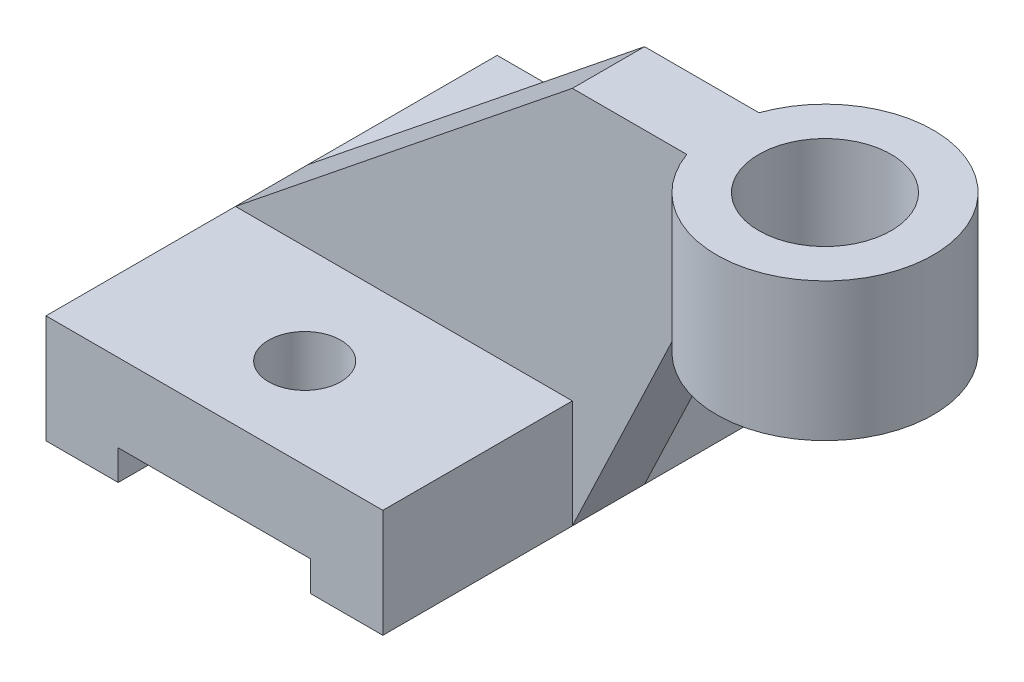
ISO-10303-21;
HEADER;
FILE_DESCRIPTION(('STEP AP214'),'2;1');
FILE_NAME('part.step','',(''),(''),'','','');
FILE_SCHEMA(('AUTOMOTIVE_DESIGN { 1 0 10303 214 1 1 1 1 }'));
ENDSEC;
DATA;
#1=APPLICATION_CONTEXT('core data for automotive mechanical design processes');
#2=APPLICATION_PROTOCOL_DEFINITION('international standard','automotive_design',2000,#1);
#3=PRODUCT_CONTEXT('',#1,'mechanical');
#4=PRODUCT('Part','Part','',(#3));
#5=PRODUCT_RELATED_PRODUCT_CATEGORY('part','',(#4));
#6=PRODUCT_DEFINITION_FORMATION('','',#4);
#7=PRODUCT_DEFINITION_CONTEXT('part definition',#1,'design');
#8=PRODUCT_DEFINITION('design','',#6,#7);
#9=PRODUCT_DEFINITION_SHAPE('','',#8);
#10=(LENGTH_UNIT() NAMED_UNIT(*) SI_UNIT(.MILLI.,.METRE.));
#11=(NAMED_UNIT(*) PLANE_ANGLE_UNIT() SI_UNIT($,.RADIAN.));
#12=(NAMED_UNIT(*) SI_UNIT($,.STERADIAN.) SOLID_ANGLE_UNIT());
#13=UNCERTAINTY_MEASURE_WITH_UNIT(LENGTH_MEASURE(1.E-05),#10,'distance_accuracy_value','');
#14=(GEOMETRIC_REPRESENTATION_CONTEXT(3) GLOBAL_UNCERTAINTY_ASSIGNED_CONTEXT((#13)) GLOBAL_UNIT_ASSIGNED_CONTEXT((#10,
#11,#12)) REPRESENTATION_CONTEXT('',''));
#15=CARTESIAN_POINT('',(0.,0.,0.));
#16=DIRECTION('',(0.,0.,1.));
#17=DIRECTION('',(1.,0.,0.));
#18=AXIS2_PLACEMENT_3D('',#15,#16,#17);
#19=CARTESIAN_POINT('',(56.,18.,0.));
#20=DIRECTION('',(1.,0.,0.));
#21=DIRECTION('',(0.,0.,-1.));
#22=AXIS2_PLACEMENT_3D('',#19,#20,#21);
#23=PLANE('',#22);
#24=DIRECTION('',(0.,0.,1.));
#25=VECTOR('',#24,1.);
#26=CARTESIAN_POINT('',(56.,18.,0.));
#27=LINE('',#26,#25);
#28=CARTESIAN_POINT('',(56.,18.,0.));
#29=VERTEX_POINT('',#28);
#30=CARTESIAN_POINT('',(56.,18.,31.5));
#31=VERTEX_POINT('',#30);
#32=EDGE_CURVE('E180',#29,#31,#27,.T.);
#33=ORIENTED_EDGE('',*,*,#32,.T.);
#34=DIRECTION('',(0.,-1.,0.));
#35=VECTOR('',#34,1.);
#36=CARTESIAN_POINT('',(56.,18.,31.5));
#37=LINE('',#36,#35);
#38=CARTESIAN_POINT('',(56.,0.,31.5));
#39=VERTEX_POINT('',#38);
#40=EDGE_CURVE('E168',#31,#39,#37,.T.);
#41=ORIENTED_EDGE('',*,*,#40,.T.);
#42=DIRECTION('',(0.,0.,1.));
#43=VECTOR('',#42,1.);
#44=CARTESIAN_POINT('',(56.,0.,0.));
#45=LINE('',#44,#43);
#46=CARTESIAN_POINT('',(56.,0.,0.));
#47=VERTEX_POINT('',#46);
#48=EDGE_CURVE('E178',#47,#39,#45,.T.);
#49=ORIENTED_EDGE('',*,*,#48,.F.);
#50=DIRECTION('',(0.,-1.,0.));
#51=VECTOR('',#50,1.);
#52=CARTESIAN_POINT('',(56.,18.,0.));
#53=LINE('',#52,#51);
#54=EDGE_CURVE('E215',#29,#47,#53,.T.);
#55=ORIENTED_EDGE('',*,*,#54,.F.);
#56=EDGE_LOOP('',(#33,#41,#49,#55));
#57=FACE_BOUND('',#56,.T.);
#58=ADVANCED_FACE('F43',(#57),#23,.T.);
#59=DIRECTION('',(0.,-1.,0.));
#60=VECTOR('',#59,1.);
#61=CARTESIAN_POINT('',(56.,18.,43.5));
#62=LINE('',#61,#60);
#63=CARTESIAN_POINT('',(56.,18.,43.5));
#64=VERTEX_POINT('',#63);
#65=CARTESIAN_POINT('',(56.,0.,43.5));
#66=VERTEX_POINT('',#65);
#67=EDGE_CURVE('E182',#64,#66,#62,.T.);
#68=ORIENTED_EDGE('',*,*,#67,.F.);
#69=CARTESIAN_POINT('',(56.,18.,75.));
#70=VERTEX_POINT('',#69);
#71=EDGE_CURVE('E232',#64,#70,#27,.T.);
#72=ORIENTED_EDGE('',*,*,#71,.T.);
#73=DIRECTION('',(0.,-1.,0.));
#74=VECTOR('',#73,1.);
#75=CARTESIAN_POINT('',(56.,18.,75.));
#76=LINE('',#75,#74);
#77=CARTESIAN_POINT('',(56.,0.,75.));
#78=VERTEX_POINT('',#77);
#79=EDGE_CURVE('E212',#70,#78,#76,.T.);
#80=ORIENTED_EDGE('',*,*,#79,.T.);
#81=EDGE_CURVE('E192',#66,#78,#45,.T.);
#82=ORIENTED_EDGE('',*,*,#81,.F.);
#83=EDGE_LOOP('',(#68,#72,#80,#82));
#84=FACE_BOUND('',#83,.T.);
#85=ADVANCED_FACE('F353',(#84),#23,.T.);
#86=CARTESIAN_POINT('',(0.,18.,0.));
#87=DIRECTION('',(0.,-1.,0.));
#88=DIRECTION('',(0.,0.,-1.));
#89=AXIS2_PLACEMENT_3D('',#86,#87,#88);
#90=PLANE('',#89);
#91=CARTESIAN_POINT('',(28.,18.,60.));
#92=DIRECTION('',(0.,1.,0.));
#93=DIRECTION('',(0.,0.,1.));
#94=AXIS2_PLACEMENT_3D('',#91,#92,#93);
#95=CIRCLE('',#94,5.99999999999999);
#96=CARTESIAN_POINT('',(28.,18.,66.));
#97=VERTEX_POINT('',#96);
#98=EDGE_CURVE('E235',#97,#97,#95,.F.);
#99=ORIENTED_EDGE('',*,*,#98,.T.);
#100=EDGE_LOOP('',(#99));
#101=FACE_BOUND('',#100,.T.);
#102=DIRECTION('',(1.,0.,0.));
#103=VECTOR('',#102,1.);
#104=CARTESIAN_POINT('',(0.,18.,43.5));
#105=LINE('',#104,#103);
#106=CARTESIAN_POINT('',(0.,18.,43.5));
#107=VERTEX_POINT('',#106);
#108=EDGE_CURVE('E61',#107,#64,#105,.T.);
#109=ORIENTED_EDGE('',*,*,#108,.F.);
#110=DIRECTION('',(0.,0.,1.));
#111=VECTOR('',#110,1.);
#112=CARTESIAN_POINT('',(0.,18.,0.));
#113=LINE('',#112,#111);
#114=CARTESIAN_POINT('',(0.,18.,75.));
#115=VERTEX_POINT('',#114);
#116=EDGE_CURVE('E221',#107,#115,#113,.T.);
#117=ORIENTED_EDGE('',*,*,#116,.T.);
#118=DIRECTION('',(1.,0.,0.));
#119=VECTOR('',#118,1.);
#120=CARTESIAN_POINT('',(0.,18.,75.));
#121=LINE('',#120,#119);
#122=EDGE_CURVE('E225',#115,#70,#121,.T.);
#123=ORIENTED_EDGE('',*,*,#122,.T.);
#124=ORIENTED_EDGE('',*,*,#71,.F.);
#125=EDGE_LOOP('',(#109,#117,#123,#124));
#126=FACE_BOUND('',#125,.T.);
#127=ADVANCED_FACE('F357',(#101,#126),#90,.F.);
#128=CARTESIAN_POINT('',(0.,0.,0.));
#129=DIRECTION('',(0.,-1.,0.));
#130=DIRECTION('',(0.,0.,-1.));
#131=AXIS2_PLACEMENT_3D('',#128,#129,#130);
#132=PLANE('',#131);
#133=DIRECTION('',(1.,0.,0.));
#134=VECTOR('',#133,1.);
#135=CARTESIAN_POINT('',(0.,0.,75.));
#136=LINE('',#135,#134);
#137=CARTESIAN_POINT('',(44.,0.,75.));
#138=VERTEX_POINT('',#137);
#139=EDGE_CURVE('E191',#138,#78,#136,.T.);
#140=ORIENTED_EDGE('',*,*,#139,.F.);
#141=DIRECTION('',(0.,0.,1.));
#142=VECTOR('',#141,1.);
#143=CARTESIAN_POINT('',(44.,0.,0.));
#144=LINE('',#143,#142);
#145=CARTESIAN_POINT('',(44.,0.,0.));
#146=VERTEX_POINT('',#145);
#147=EDGE_CURVE('E257',#146,#138,#144,.T.);
#148=ORIENTED_EDGE('',*,*,#147,.F.);
#149=DIRECTION('',(1.,0.,0.));
#150=VECTOR('',#149,1.);
#151=CARTESIAN_POINT('',(0.,0.,0.));
#152=LINE('',#151,#150);
#153=EDGE_CURVE('E188',#146,#47,#152,.T.);
#154=ORIENTED_EDGE('',*,*,#153,.T.);
#155=ORIENTED_EDGE('',*,*,#48,.T.);
#156=DIRECTION('',(0.,0.,1.));
#157=VECTOR('',#156,1.);
#158=CARTESIAN_POINT('',(56.,0.,0.));
#159=LINE('',#158,#157);
#160=EDGE_CURVE('E148',#39,#66,#159,.T.);
#161=ORIENTED_EDGE('',*,*,#160,.T.);
#162=ORIENTED_EDGE('',*,*,#81,.T.);
#163=EDGE_LOOP('',(#140,#148,#154,#155,#161,#162));
#164=FACE_BOUND('',#163,.T.);
#165=ADVANCED_FACE('F185',(#164),#132,.T.);
#166=CARTESIAN_POINT('',(0.,0.,75.));
#167=VERTEX_POINT('',#166);
#168=CARTESIAN_POINT('',(12.,0.,75.));
#169=VERTEX_POINT('',#168);
#170=EDGE_CURVE('E197',#167,#169,#136,.T.);
#171=ORIENTED_EDGE('',*,*,#170,.F.);
#172=DIRECTION('',(0.,0.,1.));
#173=VECTOR('',#172,1.);
#174=CARTESIAN_POINT('',(0.,0.,0.));
#175=LINE('',#174,#173);
#176=CARTESIAN_POINT('',(0.,0.,0.));
#177=VERTEX_POINT('',#176);
#178=EDGE_CURVE('E205',#177,#167,#175,.T.);
#179=ORIENTED_EDGE('',*,*,#178,.F.);
#180=CARTESIAN_POINT('',(12.,0.,0.));
#181=VERTEX_POINT('',#180);
#182=EDGE_CURVE('E199',#177,#181,#152,.T.);
#183=ORIENTED_EDGE('',*,*,#182,.T.);
#184=DIRECTION('',(0.,0.,1.));
#185=VECTOR('',#184,1.);
#186=CARTESIAN_POINT('',(12.,0.,0.));
#187=LINE('',#186,#185);
#188=EDGE_CURVE('E254',#181,#169,#187,.T.);
#189=ORIENTED_EDGE('',*,*,#188,.T.);
#190=EDGE_LOOP('',(#171,#179,#183,#189));
#191=FACE_BOUND('',#190,.T.);
#192=ADVANCED_FACE('F372',(#191),#132,.T.);
#193=CARTESIAN_POINT('',(0.,18.,0.));
#194=DIRECTION('',(0.,0.,-1.));
#195=DIRECTION('',(-1.,0.,0.));
#196=AXIS2_PLACEMENT_3D('',#193,#194,#195);
#197=PLANE('',#196);
#198=ORIENTED_EDGE('',*,*,#153,.F.);
#199=DIRECTION('',(0.,-1.,0.));
#200=VECTOR('',#199,1.);
#201=CARTESIAN_POINT('',(44.,0.,0.));
#202=LINE('',#201,#200);
#203=CARTESIAN_POINT('',(44.,5.,0.));
#204=VERTEX_POINT('',#203);
#205=EDGE_CURVE('E264',#204,#146,#202,.T.);
#206=ORIENTED_EDGE('',*,*,#205,.F.);
#207=DIRECTION('',(1.,0.,0.));
#208=VECTOR('',#207,1.);
#209=CARTESIAN_POINT('',(0.,5.,0.));
#210=LINE('',#209,#208);
#211=CARTESIAN_POINT('',(12.,5.,0.));
#212=VERTEX_POINT('',#211);
#213=EDGE_CURVE('E275',#212,#204,#210,.T.);
#214=ORIENTED_EDGE('',*,*,#213,.F.);
#215=DIRECTION('',(0.,1.,0.));
#216=VECTOR('',#215,1.);
#217=CARTESIAN_POINT('',(12.,0.,0.));
#218=LINE('',#217,#216);
#219=EDGE_CURVE('E251',#181,#212,#218,.T.);
#220=ORIENTED_EDGE('',*,*,#219,.F.);
#221=ORIENTED_EDGE('',*,*,#182,.F.);
#222=DIRECTION('',(0.,-1.,0.));
#223=VECTOR('',#222,1.);
#224=CARTESIAN_POINT('',(0.,18.,0.));
#225=LINE('',#224,#223);
#226=CARTESIAN_POINT('',(0.,18.,0.));
#227=VERTEX_POINT('',#226);
#228=EDGE_CURVE('E11',#227,#177,#225,.T.);
#229=ORIENTED_EDGE('',*,*,#228,.F.);
#230=DIRECTION('',(1.,0.,0.));
#231=VECTOR('',#230,1.);
#232=CARTESIAN_POINT('',(0.,18.,0.));
#233=LINE('',#232,#231);
#234=EDGE_CURVE('E207',#227,#29,#233,.T.);
#235=ORIENTED_EDGE('',*,*,#234,.T.);
#236=ORIENTED_EDGE('',*,*,#54,.T.);
#237=EDGE_LOOP('',(#198,#206,#214,#220,#221,#229,#235,#236));
#238=FACE_BOUND('',#237,.T.);
#239=ADVANCED_FACE('F45',(#238),#197,.T.);
#240=CARTESIAN_POINT('',(0.,18.,75.));
#241=DIRECTION('',(0.,0.,-1.));
#242=DIRECTION('',(-1.,0.,0.));
#243=AXIS2_PLACEMENT_3D('',#240,#241,#242);
#244=PLANE('',#243);
#245=DIRECTION('',(0.,-1.,0.));
#246=VECTOR('',#245,1.);
#247=CARTESIAN_POINT('',(44.,0.,75.));
#248=LINE('',#247,#246);
#249=CARTESIAN_POINT('',(44.,5.,75.));
#250=VERTEX_POINT('',#249);
#251=EDGE_CURVE('E269',#250,#138,#248,.T.);
#252=ORIENTED_EDGE('',*,*,#251,.T.);
#253=ORIENTED_EDGE('',*,*,#139,.T.);
#254=ORIENTED_EDGE('',*,*,#79,.F.);
#255=ORIENTED_EDGE('',*,*,#122,.F.);
#256=DIRECTION('',(0.,-1.,0.));
#257=VECTOR('',#256,1.);
#258=CARTESIAN_POINT('',(0.,18.,75.));
#259=LINE('',#258,#257);
#260=EDGE_CURVE('E53',#115,#167,#259,.T.);
#261=ORIENTED_EDGE('',*,*,#260,.T.);
#262=ORIENTED_EDGE('',*,*,#170,.T.);
#263=DIRECTION('',(0.,1.,0.));
#264=VECTOR('',#263,1.);
#265=CARTESIAN_POINT('',(12.,0.,75.));
#266=LINE('',#265,#264);
#267=CARTESIAN_POINT('',(12.,5.,75.));
#268=VERTEX_POINT('',#267);
#269=EDGE_CURVE('E260',#169,#268,#266,.T.);
#270=ORIENTED_EDGE('',*,*,#269,.T.);
#271=DIRECTION('',(1.,0.,0.));
#272=VECTOR('',#271,1.);
#273=CARTESIAN_POINT('',(0.,5.,75.));
#274=LINE('',#273,#272);
#275=EDGE_CURVE('E265',#268,#250,#274,.T.);
#276=ORIENTED_EDGE('',*,*,#275,.T.);
#277=EDGE_LOOP('',(#252,#253,#254,#255,#261,#262,#270,#276));
#278=FACE_BOUND('',#277,.T.);
#279=ADVANCED_FACE('F360',(#278),#244,.F.);
#280=CARTESIAN_POINT('',(28.,0.,60.));
#281=DIRECTION('',(0.,1.,0.));
#282=DIRECTION('',(0.,0.,1.));
#283=AXIS2_PLACEMENT_3D('',#280,#281,#282);
#284=CYLINDRICAL_SURFACE('',#283,5.99999999999999);
#285=ORIENTED_EDGE('',*,*,#98,.F.);
#286=EDGE_LOOP('',(#285));
#287=FACE_BOUND('',#286,.T.);
#288=CARTESIAN_POINT('',(28.,5.,60.));
#289=DIRECTION('',(0.,-1.,0.));
#290=DIRECTION('',(0.,0.,-1.));
#291=AXIS2_PLACEMENT_3D('',#288,#289,#290);
#292=CIRCLE('',#291,5.99999999999999);
#293=CARTESIAN_POINT('',(28.,5.,54.));
#294=VERTEX_POINT('',#293);
#295=EDGE_CURVE('E240',#294,#294,#292,.T.);
#296=ORIENTED_EDGE('',*,*,#295,.T.);
#297=EDGE_LOOP('',(#296));
#298=FACE_BOUND('',#297,.T.);
#299=ADVANCED_FACE('F363',(#287,#298),#284,.F.);
#300=CARTESIAN_POINT('',(28.,0.,15.));
#301=DIRECTION('',(0.,1.,0.));
#302=DIRECTION('',(0.,0.,1.));
#303=AXIS2_PLACEMENT_3D('',#300,#301,#302);
#304=CYLINDRICAL_SURFACE('',#303,5.99999999999999);
#305=CARTESIAN_POINT('',(28.,18.,15.));
#306=DIRECTION('',(0.,1.,0.));
#307=DIRECTION('',(0.,0.,1.));
#308=AXIS2_PLACEMENT_3D('',#305,#306,#307);
#309=CIRCLE('',#308,5.99999999999999);
#310=CARTESIAN_POINT('',(28.,18.,21.));
#311=VERTEX_POINT('',#310);
#312=EDGE_CURVE('E239',#311,#311,#309,.T.);
#313=ORIENTED_EDGE('',*,*,#312,.T.);
#314=EDGE_LOOP('',(#313));
#315=FACE_BOUND('',#314,.T.);
#316=CARTESIAN_POINT('',(28.,5.,15.));
#317=DIRECTION('',(0.,-1.,0.));
#318=DIRECTION('',(0.,0.,-1.));
#319=AXIS2_PLACEMENT_3D('',#316,#317,#318);
#320=CIRCLE('',#319,5.99999999999999);
#321=CARTESIAN_POINT('',(28.,5.,9.00000000000001));
#322=VERTEX_POINT('',#321);
#323=EDGE_CURVE('E47',#322,#322,#320,.F.);
#324=ORIENTED_EDGE('',*,*,#323,.F.);
#325=EDGE_LOOP('',(#324));
#326=FACE_BOUND('',#325,.T.);
#327=ADVANCED_FACE('F375',(#315,#326),#304,.F.);
#328=CARTESIAN_POINT('',(0.,18.,31.5));
#329=VERTEX_POINT('',#328);
#330=EDGE_CURVE('E217',#227,#329,#113,.T.);
#331=ORIENTED_EDGE('',*,*,#330,.T.);
#332=DIRECTION('',(1.,0.,0.));
#333=VECTOR('',#332,1.);
#334=CARTESIAN_POINT('',(0.,18.,31.5));
#335=LINE('',#334,#333);
#336=EDGE_CURVE('E286',#329,#31,#335,.T.);
#337=ORIENTED_EDGE('',*,*,#336,.T.);
#338=ORIENTED_EDGE('',*,*,#32,.F.);
#339=ORIENTED_EDGE('',*,*,#234,.F.);
#340=EDGE_LOOP('',(#331,#337,#338,#339));
#341=FACE_BOUND('',#340,.T.);
#342=ORIENTED_EDGE('',*,*,#312,.F.);
#343=EDGE_LOOP('',(#342));
#344=FACE_BOUND('',#343,.T.);
#345=ADVANCED_FACE('F369',(#341,#344),#90,.F.);
#346=CARTESIAN_POINT('',(0.,18.,0.));
#347=DIRECTION('',(1.,0.,0.));
#348=DIRECTION('',(0.,0.,-1.));
#349=AXIS2_PLACEMENT_3D('',#346,#347,#348);
#350=PLANE('',#349);
#351=ORIENTED_EDGE('',*,*,#116,.F.);
#352=DIRECTION('',(0.,0.,-1.));
#353=VECTOR('',#352,1.);
#354=CARTESIAN_POINT('',(0.,18.,43.5));
#355=LINE('',#354,#353);
#356=EDGE_CURVE('E68',#107,#329,#355,.T.);
#357=ORIENTED_EDGE('',*,*,#356,.T.);
#358=ORIENTED_EDGE('',*,*,#330,.F.);
#359=ORIENTED_EDGE('',*,*,#228,.T.);
#360=ORIENTED_EDGE('',*,*,#178,.T.);
#361=ORIENTED_EDGE('',*,*,#260,.F.);
#362=EDGE_LOOP('',(#351,#357,#358,#359,#360,#361));
#363=FACE_BOUND('',#362,.T.);
#364=ADVANCED_FACE('F365',(#363),#350,.F.);
#365=CARTESIAN_POINT('',(0.,5.,0.));
#366=DIRECTION('',(0.,-1.,0.));
#367=DIRECTION('',(0.,0.,-1.));
#368=AXIS2_PLACEMENT_3D('',#365,#366,#367);
#369=PLANE('',#368);
#370=ORIENTED_EDGE('',*,*,#275,.F.);
#371=DIRECTION('',(0.,0.,1.));
#372=VECTOR('',#371,1.);
#373=CARTESIAN_POINT('',(12.,5.,0.));
#374=LINE('',#373,#372);
#375=EDGE_CURVE('E250',#212,#268,#374,.T.);
#376=ORIENTED_EDGE('',*,*,#375,.F.);
#377=ORIENTED_EDGE('',*,*,#213,.T.);
#378=DIRECTION('',(0.,0.,1.));
#379=VECTOR('',#378,1.);
#380=CARTESIAN_POINT('',(44.,5.,0.));
#381=LINE('',#380,#379);
#382=EDGE_CURVE('E247',#204,#250,#381,.T.);
#383=ORIENTED_EDGE('',*,*,#382,.T.);
#384=EDGE_LOOP('',(#370,#376,#377,#383));
#385=FACE_BOUND('',#384,.T.);
#386=ORIENTED_EDGE('',*,*,#295,.F.);
#387=EDGE_LOOP('',(#386));
#388=FACE_BOUND('',#387,.T.);
#389=ORIENTED_EDGE('',*,*,#323,.T.);
#390=EDGE_LOOP('',(#389));
#391=FACE_BOUND('',#390,.T.);
#392=ADVANCED_FACE('F368',(#385,#388,#391),#369,.T.);
#393=CARTESIAN_POINT('',(44.,0.,0.));
#394=DIRECTION('',(-1.,0.,0.));
#395=DIRECTION('',(0.,0.,1.));
#396=AXIS2_PLACEMENT_3D('',#393,#394,#395);
#397=PLANE('',#396);
#398=ORIENTED_EDGE('',*,*,#251,.F.);
#399=ORIENTED_EDGE('',*,*,#382,.F.);
#400=ORIENTED_EDGE('',*,*,#205,.T.);
#401=ORIENTED_EDGE('',*,*,#147,.T.);
#402=EDGE_LOOP('',(#398,#399,#400,#401));
#403=FACE_BOUND('',#402,.T.);
#404=ADVANCED_FACE('F382',(#403),#397,.T.);
#405=CARTESIAN_POINT('',(12.,0.,0.));
#406=DIRECTION('',(1.,0.,0.));
#407=DIRECTION('',(0.,0.,-1.));
#408=AXIS2_PLACEMENT_3D('',#405,#406,#407);
#409=PLANE('',#408);
#410=ORIENTED_EDGE('',*,*,#269,.F.);
#411=ORIENTED_EDGE('',*,*,#188,.F.);
#412=ORIENTED_EDGE('',*,*,#219,.T.);
#413=ORIENTED_EDGE('',*,*,#375,.T.);
#414=EDGE_LOOP('',(#410,#411,#412,#413));
#415=FACE_BOUND('',#414,.T.);
#416=ADVANCED_FACE('F385',(#415),#409,.T.);
#417=CARTESIAN_POINT('',(0.,18.,43.5));
#418=DIRECTION('',(0.626391108316048,-0.779508934793305,0.));
#419=DIRECTION('',(0.779508934793305,0.626391108316048,0.));
#420=AXIS2_PLACEMENT_3D('',#417,#418,#419);
#421=PLANE('',#420);
#422=DIRECTION('',(-0.779508934793305,-0.626391108316048,0.));
#423=VECTOR('',#422,1.);
#424=CARTESIAN_POINT('',(0.,18.,31.5));
#425=LINE('',#424,#423);
#426=CARTESIAN_POINT('',(56.,63.,31.5));
#427=VERTEX_POINT('',#426);
#428=EDGE_CURVE('E290',#427,#329,#425,.T.);
#429=ORIENTED_EDGE('',*,*,#428,.T.);
#430=ORIENTED_EDGE('',*,*,#356,.F.);
#431=DIRECTION('',(-0.779508934793305,-0.626391108316048,0.));
#432=VECTOR('',#431,1.);
#433=CARTESIAN_POINT('',(0.,18.,43.5));
#434=LINE('',#433,#432);
#435=CARTESIAN_POINT('',(56.,63.,43.5));
#436=VERTEX_POINT('',#435);
#437=EDGE_CURVE('E289',#436,#107,#434,.T.);
#438=ORIENTED_EDGE('',*,*,#437,.F.);
#439=DIRECTION('',(0.,0.,-1.));
#440=VECTOR('',#439,1.);
#441=CARTESIAN_POINT('',(56.,63.,43.5));
#442=LINE('',#441,#440);
#443=EDGE_CURVE('E282',#436,#427,#442,.T.);
#444=ORIENTED_EDGE('',*,*,#443,.T.);
#445=EDGE_LOOP('',(#429,#430,#438,#444));
#446=FACE_BOUND('',#445,.T.);
#447=ADVANCED_FACE('F392',(#446),#421,.F.);
#448=CARTESIAN_POINT('',(0.,0.,43.5));
#449=DIRECTION('',(0.,0.,1.));
#450=DIRECTION('',(1.,0.,0.));
#451=AXIS2_PLACEMENT_3D('',#448,#449,#450);
#452=PLANE('',#451);
#453=ORIENTED_EDGE('',*,*,#437,.T.);
#454=ORIENTED_EDGE('',*,*,#108,.T.);
#455=ORIENTED_EDGE('',*,*,#67,.T.);
#456=DIRECTION('',(0.429598959000717,0.903019786286824,0.));
#457=VECTOR('',#456,1.);
#458=CARTESIAN_POINT('',(56.,0.,43.5));
#459=LINE('',#458,#457);
#460=CARTESIAN_POINT('',(75.0294372515229,40.,43.5));
#461=VERTEX_POINT('',#460);
#462=EDGE_CURVE('E154',#66,#461,#459,.T.);
#463=ORIENTED_EDGE('',*,*,#462,.T.);
#464=DIRECTION('',(0.,1.,0.));
#465=VECTOR('',#464,1.);
#466=CARTESIAN_POINT('',(75.0294372515229,40.,43.5));
#467=LINE('',#466,#465);
#468=CARTESIAN_POINT('',(75.0294372515229,63.,43.5));
#469=VERTEX_POINT('',#468);
#470=EDGE_CURVE('E299',#461,#469,#467,.T.);
#471=ORIENTED_EDGE('',*,*,#470,.T.);
#472=DIRECTION('',(1.,0.,0.));
#473=VECTOR('',#472,1.);
#474=CARTESIAN_POINT('',(56.,63.,43.5));
#475=LINE('',#474,#473);
#476=EDGE_CURVE('E312',#436,#469,#475,.T.);
#477=ORIENTED_EDGE('',*,*,#476,.F.);
#478=EDGE_LOOP('',(#453,#454,#455,#463,#471,#477));
#479=FACE_BOUND('',#478,.T.);
#480=ADVANCED_FACE('F332',(#479),#452,.T.);
#481=CARTESIAN_POINT('',(0.,0.,31.5));
#482=DIRECTION('',(0.,0.,1.));
#483=DIRECTION('',(1.,0.,0.));
#484=AXIS2_PLACEMENT_3D('',#481,#482,#483);
#485=PLANE('',#484);
#486=ORIENTED_EDGE('',*,*,#428,.F.);
#487=DIRECTION('',(-1.,0.,0.));
#488=VECTOR('',#487,1.);
#489=CARTESIAN_POINT('',(56.,63.,31.5));
#490=LINE('',#489,#488);
#491=CARTESIAN_POINT('',(75.0294372515229,63.,31.5));
#492=VERTEX_POINT('',#491);
#493=EDGE_CURVE('E305',#492,#427,#490,.T.);
#494=ORIENTED_EDGE('',*,*,#493,.F.);
#495=DIRECTION('',(0.,1.,0.));
#496=VECTOR('',#495,1.);
#497=CARTESIAN_POINT('',(75.0294372515229,40.,31.5));
#498=LINE('',#497,#496);
#499=CARTESIAN_POINT('',(75.0294372515229,40.,31.5));
#500=VERTEX_POINT('',#499);
#501=EDGE_CURVE('E171',#500,#492,#498,.T.);
#502=ORIENTED_EDGE('',*,*,#501,.F.);
#503=DIRECTION('',(0.429598959000717,0.903019786286824,0.));
#504=VECTOR('',#503,1.);
#505=CARTESIAN_POINT('',(56.,0.,31.5));
#506=LINE('',#505,#504);
#507=EDGE_CURVE('E151',#39,#500,#506,.T.);
#508=ORIENTED_EDGE('',*,*,#507,.F.);
#509=ORIENTED_EDGE('',*,*,#40,.F.);
#510=ORIENTED_EDGE('',*,*,#336,.F.);
#511=EDGE_LOOP('',(#486,#494,#502,#508,#509,#510));
#512=FACE_BOUND('',#511,.T.);
#513=ADVANCED_FACE('F166',(#512),#485,.F.);
#514=CARTESIAN_POINT('',(92.,40.,37.5));
#515=DIRECTION('',(0.,1.,0.));
#516=DIRECTION('',(0.,0.,1.));
#517=AXIS2_PLACEMENT_3D('',#514,#515,#516);
#518=CYLINDRICAL_SURFACE('',#517,18.);
#519=CARTESIAN_POINT('',(92.,63.,37.5));
#520=DIRECTION('',(0.,1.,0.));
#521=DIRECTION('',(0.,0.,1.));
#522=AXIS2_PLACEMENT_3D('',#519,#520,#521);
#523=CIRCLE('',#522,18.);
#524=EDGE_CURVE('E308',#469,#492,#523,.T.);
#525=ORIENTED_EDGE('',*,*,#524,.F.);
#526=ORIENTED_EDGE('',*,*,#470,.F.);
#527=CARTESIAN_POINT('',(92.,40.,37.5));
#528=DIRECTION('',(0.,1.,0.));
#529=DIRECTION('',(0.,0.,1.));
#530=AXIS2_PLACEMENT_3D('',#527,#528,#529);
#531=CIRCLE('',#530,18.);
#532=EDGE_CURVE('E302',#461,#500,#531,.T.);
#533=ORIENTED_EDGE('',*,*,#532,.T.);
#534=ORIENTED_EDGE('',*,*,#501,.T.);
#535=EDGE_LOOP('',(#525,#526,#533,#534));
#536=FACE_BOUND('',#535,.T.);
#537=ADVANCED_FACE('F336',(#536),#518,.T.);
#538=CARTESIAN_POINT('',(92.,40.,37.5));
#539=DIRECTION('',(0.,1.,0.));
#540=DIRECTION('',(0.,0.,1.));
#541=AXIS2_PLACEMENT_3D('',#538,#539,#540);
#542=PLANE('',#541);
#543=CARTESIAN_POINT('',(92.,40.,37.5));
#544=DIRECTION('',(0.,1.,0.));
#545=DIRECTION('',(0.,0.,1.));
#546=AXIS2_PLACEMENT_3D('',#543,#544,#545);
#547=CIRCLE('',#546,11.);
#548=CARTESIAN_POINT('',(92.,40.,48.5));
#549=VERTEX_POINT('',#548);
#550=EDGE_CURVE('E316',#549,#549,#547,.T.);
#551=ORIENTED_EDGE('',*,*,#550,.T.);
#552=EDGE_LOOP('',(#551));
#553=FACE_BOUND('',#552,.T.);
#554=ORIENTED_EDGE('',*,*,#532,.F.);
#555=DIRECTION('',(0.,0.,-1.));
#556=VECTOR('',#555,1.);
#557=CARTESIAN_POINT('',(75.0294372515229,40.,37.5));
#558=LINE('',#557,#556);
#559=EDGE_CURVE('E160',#461,#500,#558,.T.);
#560=ORIENTED_EDGE('',*,*,#559,.T.);
#561=EDGE_LOOP('',(#554,#560));
#562=FACE_BOUND('',#561,.T.);
#563=ADVANCED_FACE('F338',(#553,#562),#542,.F.);
#564=CARTESIAN_POINT('',(92.,63.,37.5));
#565=DIRECTION('',(0.,1.,0.));
#566=DIRECTION('',(0.,0.,1.));
#567=AXIS2_PLACEMENT_3D('',#564,#565,#566);
#568=PLANE('',#567);
#569=CARTESIAN_POINT('',(92.,63.,37.5));
#570=DIRECTION('',(0.,1.,0.));
#571=DIRECTION('',(0.,0.,1.));
#572=AXIS2_PLACEMENT_3D('',#569,#570,#571);
#573=CIRCLE('',#572,11.);
#574=CARTESIAN_POINT('',(92.,63.,48.5));
#575=VERTEX_POINT('',#574);
#576=EDGE_CURVE('E159',#575,#575,#573,.T.);
#577=ORIENTED_EDGE('',*,*,#576,.F.);
#578=EDGE_LOOP('',(#577));
#579=FACE_BOUND('',#578,.T.);
#580=ORIENTED_EDGE('',*,*,#476,.T.);
#581=ORIENTED_EDGE('',*,*,#524,.T.);
#582=ORIENTED_EDGE('',*,*,#493,.T.);
#583=ORIENTED_EDGE('',*,*,#443,.F.);
#584=EDGE_LOOP('',(#580,#581,#582,#583));
#585=FACE_BOUND('',#584,.T.);
#586=ADVANCED_FACE('F340',(#579,#585),#568,.T.);
#587=CARTESIAN_POINT('',(92.,40.,37.5));
#588=DIRECTION('',(0.,1.,0.));
#589=DIRECTION('',(0.,0.,1.));
#590=AXIS2_PLACEMENT_3D('',#587,#588,#589);
#591=CYLINDRICAL_SURFACE('',#590,11.);
#592=ORIENTED_EDGE('',*,*,#576,.T.);
#593=EDGE_LOOP('',(#592));
#594=FACE_BOUND('',#593,.T.);
#595=ORIENTED_EDGE('',*,*,#550,.F.);
#596=EDGE_LOOP('',(#595));
#597=FACE_BOUND('',#596,.T.);
#598=ADVANCED_FACE('F347',(#594,#597),#591,.F.);
#599=CARTESIAN_POINT('',(56.,0.,37.5));
#600=DIRECTION('',(0.903019786286824,-0.429598959000717,0.));
#601=DIRECTION('',(0.429598959000717,0.903019786286824,0.));
#602=AXIS2_PLACEMENT_3D('',#599,#600,#601);
#603=PLANE('',#602);
#604=ORIENTED_EDGE('',*,*,#160,.F.);
#605=ORIENTED_EDGE('',*,*,#507,.T.);
#606=ORIENTED_EDGE('',*,*,#559,.F.);
#607=ORIENTED_EDGE('',*,*,#462,.F.);
#608=EDGE_LOOP('',(#604,#605,#606,#607));
#609=FACE_BOUND('',#608,.T.);
#610=ADVANCED_FACE('F150',(#609),#603,.T.);
#611=CLOSED_SHELL('',(#58,#85,#127,#165,#192,#239,#279,#299,#327,#345,#364,#392,#404,#416,#447,
#480,#513,#537,#563,#586,#598,#610));
#612=MANIFOLD_SOLID_BREP('B2',#611);
#613=ADVANCED_BREP_SHAPE_REPRESENTATION('',(#18,#612),#14);
#614=SHAPE_DEFINITION_REPRESENTATION(#9,#613);
ENDSEC;
END-ISO-10303-21;
